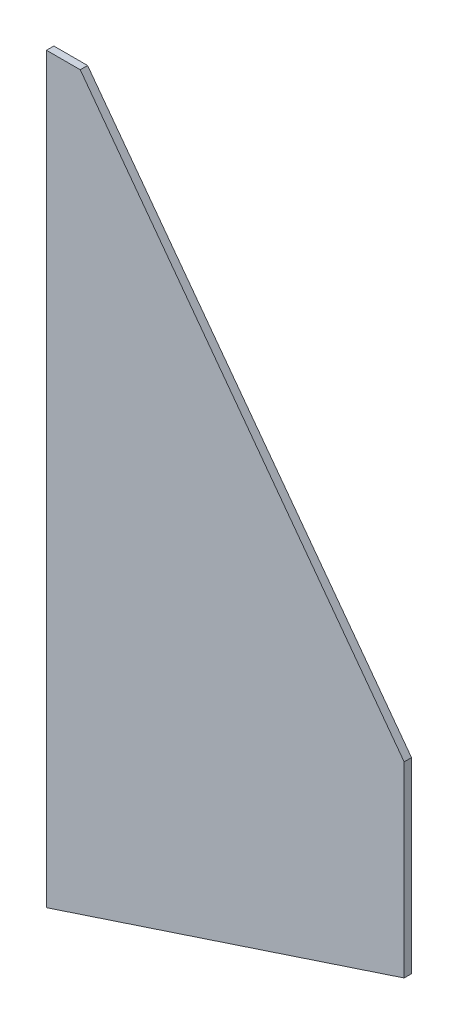
ISO-10303-21;
HEADER;
FILE_DESCRIPTION(('STEP AP214'),'2;1');
FILE_NAME('part.step','',(''),(''),'','','');
FILE_SCHEMA(('AUTOMOTIVE_DESIGN { 1 0 10303 214 1 1 1 1 }'));
ENDSEC;
DATA;
#1=APPLICATION_CONTEXT('core data for automotive mechanical design processes');
#2=APPLICATION_PROTOCOL_DEFINITION('international standard','automotive_design',2000,#1);
#3=PRODUCT_CONTEXT('',#1,'mechanical');
#4=PRODUCT('Part','Part','',(#3));
#5=PRODUCT_RELATED_PRODUCT_CATEGORY('part','',(#4));
#6=PRODUCT_DEFINITION_FORMATION('','',#4);
#7=PRODUCT_DEFINITION_CONTEXT('part definition',#1,'design');
#8=PRODUCT_DEFINITION('design','',#6,#7);
#9=PRODUCT_DEFINITION_SHAPE('','',#8);
#10=(LENGTH_UNIT() NAMED_UNIT(*) SI_UNIT(.MILLI.,.METRE.));
#11=(NAMED_UNIT(*) PLANE_ANGLE_UNIT() SI_UNIT($,.RADIAN.));
#12=(NAMED_UNIT(*) SI_UNIT($,.STERADIAN.) SOLID_ANGLE_UNIT());
#13=UNCERTAINTY_MEASURE_WITH_UNIT(LENGTH_MEASURE(1.E-05),#10,'distance_accuracy_value','');
#14=(GEOMETRIC_REPRESENTATION_CONTEXT(3) GLOBAL_UNCERTAINTY_ASSIGNED_CONTEXT((#13)) GLOBAL_UNIT_ASSIGNED_CONTEXT((#10,
#11,#12)) REPRESENTATION_CONTEXT('',''));
#15=CARTESIAN_POINT('',(0.,0.,0.));
#16=DIRECTION('',(0.,0.,1.));
#17=DIRECTION('',(1.,0.,0.));
#18=AXIS2_PLACEMENT_3D('',#15,#16,#17);
#19=CARTESIAN_POINT('',(-65.1467888307155,-103.390855148342,2.9972));
#20=DIRECTION('',(-0.313129198914679,0.949710537367598,0.));
#21=DIRECTION('',(-0.949710537367598,-0.313129198914679,0.));
#22=AXIS2_PLACEMENT_3D('',#19,#20,#21);
#23=PLANE('',#22);
#24=DIRECTION('',(0.949710537367598,0.313129198914679,0.));
#25=VECTOR('',#24,1.);
#26=CARTESIAN_POINT('',(-65.1467888307155,-103.390855148342,0.));
#27=LINE('',#26,#25);
#28=CARTESIAN_POINT('',(-65.1467888307155,-103.390855148342,0.));
#29=VERTEX_POINT('',#28);
#30=CARTESIAN_POINT('',(80.4444153577662,-55.3879581151832,0.));
#31=VERTEX_POINT('',#30);
#32=EDGE_CURVE('E111',#29,#31,#27,.T.);
#33=ORIENTED_EDGE('',*,*,#32,.T.);
#34=DIRECTION('',(0.,0.,-1.));
#35=VECTOR('',#34,1.);
#36=CARTESIAN_POINT('',(80.4444153577662,-55.3879581151832,2.9972));
#37=LINE('',#36,#35);
#38=CARTESIAN_POINT('',(80.4444153577662,-55.3879581151832,2.9972));
#39=VERTEX_POINT('',#38);
#40=EDGE_CURVE('E11',#39,#31,#37,.T.);
#41=ORIENTED_EDGE('',*,*,#40,.F.);
#42=DIRECTION('',(0.949710537367598,0.313129198914679,0.));
#43=VECTOR('',#42,1.);
#44=CARTESIAN_POINT('',(-65.1467888307155,-103.390855148342,2.9972));
#45=LINE('',#44,#43);
#46=CARTESIAN_POINT('',(-65.1467888307155,-103.390855148342,2.9972));
#47=VERTEX_POINT('',#46);
#48=EDGE_CURVE('E119',#47,#39,#45,.T.);
#49=ORIENTED_EDGE('',*,*,#48,.F.);
#50=DIRECTION('',(0.,0.,-1.));
#51=VECTOR('',#50,1.);
#52=CARTESIAN_POINT('',(-65.1467888307155,-103.390855148342,2.9972));
#53=LINE('',#52,#51);
#54=EDGE_CURVE('E107',#47,#29,#53,.T.);
#55=ORIENTED_EDGE('',*,*,#54,.T.);
#56=EDGE_LOOP('',(#33,#41,#49,#55));
#57=FACE_BOUND('',#56,.T.);
#58=ADVANCED_FACE('F37',(#57),#23,.F.);
#59=CARTESIAN_POINT('',(80.4444153577662,-55.3879581151832,2.9972));
#60=DIRECTION('',(-1.,0.,0.));
#61=DIRECTION('',(0.,0.,1.));
#62=AXIS2_PLACEMENT_3D('',#59,#60,#61);
#63=PLANE('',#62);
#64=DIRECTION('',(0.,1.,0.));
#65=VECTOR('',#64,1.);
#66=CARTESIAN_POINT('',(80.4444153577662,-55.3879581151832,0.));
#67=LINE('',#66,#65);
#68=CARTESIAN_POINT('',(80.4444153577662,20.8120418848168,0.));
#69=VERTEX_POINT('',#68);
#70=EDGE_CURVE('E114',#31,#69,#67,.T.);
#71=ORIENTED_EDGE('',*,*,#70,.T.);
#72=DIRECTION('',(0.,0.,-1.));
#73=VECTOR('',#72,1.);
#74=CARTESIAN_POINT('',(80.4444153577662,20.8120418848168,2.9972));
#75=LINE('',#74,#73);
#76=CARTESIAN_POINT('',(80.4444153577662,20.8120418848168,2.9972));
#77=VERTEX_POINT('',#76);
#78=EDGE_CURVE('E45',#77,#69,#75,.T.);
#79=ORIENTED_EDGE('',*,*,#78,.F.);
#80=DIRECTION('',(0.,1.,0.));
#81=VECTOR('',#80,1.);
#82=CARTESIAN_POINT('',(80.4444153577662,-55.3879581151832,2.9972));
#83=LINE('',#82,#81);
#84=EDGE_CURVE('E87',#39,#77,#83,.T.);
#85=ORIENTED_EDGE('',*,*,#84,.F.);
#86=ORIENTED_EDGE('',*,*,#40,.T.);
#87=EDGE_LOOP('',(#71,#79,#85,#86));
#88=FACE_BOUND('',#87,.T.);
#89=ADVANCED_FACE('F138',(#88),#63,.F.);
#90=CARTESIAN_POINT('',(-51.4053888307156,198.869144851658,2.9972));
#91=DIRECTION('',(-0.803652916693234,-0.595098302375715,0.));
#92=DIRECTION('',(0.595098302375715,-0.803652916693234,0.));
#93=AXIS2_PLACEMENT_3D('',#90,#91,#92);
#94=PLANE('',#93);
#95=DIRECTION('',(-0.595098302375715,0.803652916693234,0.));
#96=VECTOR('',#95,1.);
#97=CARTESIAN_POINT('',(-51.4053888307156,198.869144851658,0.));
#98=LINE('',#97,#96);
#99=CARTESIAN_POINT('',(-51.4053888307156,198.869144851658,0.));
#100=VERTEX_POINT('',#99);
#101=EDGE_CURVE('E102',#69,#100,#98,.T.);
#102=ORIENTED_EDGE('',*,*,#101,.T.);
#103=DIRECTION('',(0.,0.,-1.));
#104=VECTOR('',#103,1.);
#105=CARTESIAN_POINT('',(-51.4053888307156,198.869144851658,2.9972));
#106=LINE('',#105,#104);
#107=CARTESIAN_POINT('',(-51.4053888307156,198.869144851658,2.9972));
#108=VERTEX_POINT('',#107);
#109=EDGE_CURVE('E99',#108,#100,#106,.T.);
#110=ORIENTED_EDGE('',*,*,#109,.F.);
#111=DIRECTION('',(-0.595098302375715,0.803652916693234,0.));
#112=VECTOR('',#111,1.);
#113=CARTESIAN_POINT('',(-51.4053888307156,198.869144851658,2.9972));
#114=LINE('',#113,#112);
#115=EDGE_CURVE('E91',#77,#108,#114,.T.);
#116=ORIENTED_EDGE('',*,*,#115,.F.);
#117=ORIENTED_EDGE('',*,*,#78,.T.);
#118=EDGE_LOOP('',(#102,#110,#116,#117));
#119=FACE_BOUND('',#118,.T.);
#120=ADVANCED_FACE('F100',(#119),#94,.F.);
#121=CARTESIAN_POINT('',(-65.1467888307155,198.869144851658,2.9972));
#122=DIRECTION('',(0.,-1.,0.));
#123=DIRECTION('',(0.,0.,-1.));
#124=AXIS2_PLACEMENT_3D('',#121,#122,#123);
#125=PLANE('',#124);
#126=DIRECTION('',(-1.,0.,0.));
#127=VECTOR('',#126,1.);
#128=CARTESIAN_POINT('',(-65.1467888307155,198.869144851658,0.));
#129=LINE('',#128,#127);
#130=CARTESIAN_POINT('',(-65.1467888307155,198.869144851658,0.));
#131=VERTEX_POINT('',#130);
#132=EDGE_CURVE('E73',#100,#131,#129,.T.);
#133=ORIENTED_EDGE('',*,*,#132,.T.);
#134=DIRECTION('',(0.,0.,-1.));
#135=VECTOR('',#134,1.);
#136=CARTESIAN_POINT('',(-65.1467888307155,198.869144851658,2.9972));
#137=LINE('',#136,#135);
#138=CARTESIAN_POINT('',(-65.1467888307155,198.869144851658,2.9972));
#139=VERTEX_POINT('',#138);
#140=EDGE_CURVE('E103',#139,#131,#137,.T.);
#141=ORIENTED_EDGE('',*,*,#140,.F.);
#142=DIRECTION('',(-1.,0.,0.));
#143=VECTOR('',#142,1.);
#144=CARTESIAN_POINT('',(-65.1467888307155,198.869144851658,2.9972));
#145=LINE('',#144,#143);
#146=EDGE_CURVE('E95',#108,#139,#145,.T.);
#147=ORIENTED_EDGE('',*,*,#146,.F.);
#148=ORIENTED_EDGE('',*,*,#109,.T.);
#149=EDGE_LOOP('',(#133,#141,#147,#148));
#150=FACE_BOUND('',#149,.T.);
#151=ADVANCED_FACE('F105',(#150),#125,.F.);
#152=CARTESIAN_POINT('',(-65.1467888307155,198.869144851658,2.9972));
#153=DIRECTION('',(1.,0.,0.));
#154=DIRECTION('',(0.,0.,-1.));
#155=AXIS2_PLACEMENT_3D('',#152,#153,#154);
#156=PLANE('',#155);
#157=DIRECTION('',(0.,-1.,0.));
#158=VECTOR('',#157,1.);
#159=CARTESIAN_POINT('',(-65.1467888307155,198.869144851658,0.));
#160=LINE('',#159,#158);
#161=EDGE_CURVE('E79',#131,#29,#160,.T.);
#162=ORIENTED_EDGE('',*,*,#161,.T.);
#163=ORIENTED_EDGE('',*,*,#54,.F.);
#164=DIRECTION('',(0.,-1.,0.));
#165=VECTOR('',#164,1.);
#166=CARTESIAN_POINT('',(-65.1467888307155,198.869144851658,2.9972));
#167=LINE('',#166,#165);
#168=EDGE_CURVE('E53',#139,#47,#167,.T.);
#169=ORIENTED_EDGE('',*,*,#168,.F.);
#170=ORIENTED_EDGE('',*,*,#140,.T.);
#171=EDGE_LOOP('',(#162,#163,#169,#170));
#172=FACE_BOUND('',#171,.T.);
#173=ADVANCED_FACE('F127',(#172),#156,.F.);
#174=CARTESIAN_POINT('',(0.,0.,2.9972));
#175=DIRECTION('',(0.,0.,1.));
#176=DIRECTION('',(1.,0.,0.));
#177=AXIS2_PLACEMENT_3D('',#174,#175,#176);
#178=PLANE('',#177);
#179=ORIENTED_EDGE('',*,*,#48,.T.);
#180=ORIENTED_EDGE('',*,*,#84,.T.);
#181=ORIENTED_EDGE('',*,*,#115,.T.);
#182=ORIENTED_EDGE('',*,*,#146,.T.);
#183=ORIENTED_EDGE('',*,*,#168,.T.);
#184=EDGE_LOOP('',(#179,#180,#181,#182,#183));
#185=FACE_BOUND('',#184,.T.);
#186=ADVANCED_FACE('F93',(#185),#178,.T.);
#187=CARTESIAN_POINT('',(0.,0.,0.));
#188=DIRECTION('',(0.,0.,1.));
#189=DIRECTION('',(1.,0.,0.));
#190=AXIS2_PLACEMENT_3D('',#187,#188,#189);
#191=PLANE('',#190);
#192=ORIENTED_EDGE('',*,*,#32,.F.);
#193=ORIENTED_EDGE('',*,*,#161,.F.);
#194=ORIENTED_EDGE('',*,*,#132,.F.);
#195=ORIENTED_EDGE('',*,*,#101,.F.);
#196=ORIENTED_EDGE('',*,*,#70,.F.);
#197=EDGE_LOOP('',(#192,#193,#194,#195,#196));
#198=FACE_BOUND('',#197,.T.);
#199=ADVANCED_FACE('F123',(#198),#191,.F.);
#200=CLOSED_SHELL('',(#58,#89,#120,#151,#173,#186,#199));
#201=MANIFOLD_SOLID_BREP('B2',#200);
#202=ADVANCED_BREP_SHAPE_REPRESENTATION('',(#18,#201),#14);
#203=SHAPE_DEFINITION_REPRESENTATION(#9,#202);
ENDSEC;
END-ISO-10303-21;
